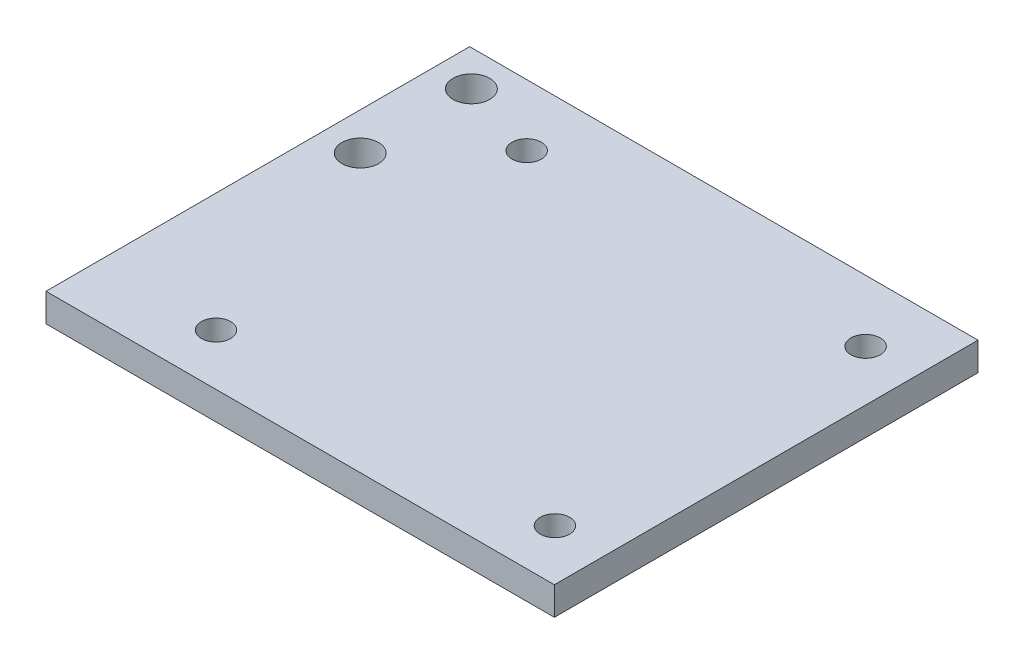
ISO-10303-21;
HEADER;
FILE_DESCRIPTION(('STEP AP214'),'2;1');
FILE_NAME('part.step','',(''),(''),'','','');
FILE_SCHEMA(('AUTOMOTIVE_DESIGN { 1 0 10303 214 1 1 1 1 }'));
ENDSEC;
DATA;
#1=APPLICATION_CONTEXT('core data for automotive mechanical design processes');
#2=APPLICATION_PROTOCOL_DEFINITION('international standard','automotive_design',2000,#1);
#3=PRODUCT_CONTEXT('',#1,'mechanical');
#4=PRODUCT('Part','Part','',(#3));
#5=PRODUCT_RELATED_PRODUCT_CATEGORY('part','',(#4));
#6=PRODUCT_DEFINITION_FORMATION('','',#4);
#7=PRODUCT_DEFINITION_CONTEXT('part definition',#1,'design');
#8=PRODUCT_DEFINITION('design','',#6,#7);
#9=PRODUCT_DEFINITION_SHAPE('','',#8);
#10=(LENGTH_UNIT() NAMED_UNIT(*) SI_UNIT(.MILLI.,.METRE.));
#11=(NAMED_UNIT(*) PLANE_ANGLE_UNIT() SI_UNIT($,.RADIAN.));
#12=(NAMED_UNIT(*) SI_UNIT($,.STERADIAN.) SOLID_ANGLE_UNIT());
#13=UNCERTAINTY_MEASURE_WITH_UNIT(LENGTH_MEASURE(1.E-05),#10,'distance_accuracy_value','');
#14=(GEOMETRIC_REPRESENTATION_CONTEXT(3) GLOBAL_UNCERTAINTY_ASSIGNED_CONTEXT((#13)) GLOBAL_UNIT_ASSIGNED_CONTEXT((#10,
#11,#12)) REPRESENTATION_CONTEXT('',''));
#15=CARTESIAN_POINT('',(0.,0.,0.));
#16=DIRECTION('',(0.,0.,1.));
#17=DIRECTION('',(1.,0.,0.));
#18=AXIS2_PLACEMENT_3D('',#15,#16,#17);
#19=CARTESIAN_POINT('',(0.,2.54,0.));
#20=DIRECTION('',(1.,0.,0.));
#21=DIRECTION('',(0.,0.,-1.));
#22=AXIS2_PLACEMENT_3D('',#19,#20,#21);
#23=PLANE('',#22);
#24=DIRECTION('',(0.,0.,1.));
#25=VECTOR('',#24,1.);
#26=CARTESIAN_POINT('',(0.,0.,0.));
#27=LINE('',#26,#25);
#28=CARTESIAN_POINT('',(0.,0.,-38.1));
#29=VERTEX_POINT('',#28);
#30=CARTESIAN_POINT('',(0.,0.,0.));
#31=VERTEX_POINT('',#30);
#32=EDGE_CURVE('E107',#29,#31,#27,.T.);
#33=ORIENTED_EDGE('',*,*,#32,.T.);
#34=DIRECTION('',(0.,-1.,0.));
#35=VECTOR('',#34,1.);
#36=CARTESIAN_POINT('',(0.,2.54,0.));
#37=LINE('',#36,#35);
#38=CARTESIAN_POINT('',(0.,2.54,0.));
#39=VERTEX_POINT('',#38);
#40=EDGE_CURVE('E11',#39,#31,#37,.T.);
#41=ORIENTED_EDGE('',*,*,#40,.F.);
#42=DIRECTION('',(0.,0.,1.));
#43=VECTOR('',#42,1.);
#44=CARTESIAN_POINT('',(0.,2.54,0.));
#45=LINE('',#44,#43);
#46=CARTESIAN_POINT('',(0.,2.54,-38.1));
#47=VERTEX_POINT('',#46);
#48=EDGE_CURVE('E91',#47,#39,#45,.T.);
#49=ORIENTED_EDGE('',*,*,#48,.F.);
#50=DIRECTION('',(0.,-1.,0.));
#51=VECTOR('',#50,1.);
#52=CARTESIAN_POINT('',(0.,2.54,-38.1));
#53=LINE('',#52,#51);
#54=EDGE_CURVE('E103',#47,#29,#53,.T.);
#55=ORIENTED_EDGE('',*,*,#54,.T.);
#56=EDGE_LOOP('',(#33,#41,#49,#55));
#57=FACE_BOUND('',#56,.T.);
#58=ADVANCED_FACE('F39',(#57),#23,.F.);
#59=CARTESIAN_POINT('',(0.,2.54,0.));
#60=DIRECTION('',(0.,0.,-1.));
#61=DIRECTION('',(-1.,0.,0.));
#62=AXIS2_PLACEMENT_3D('',#59,#60,#61);
#63=PLANE('',#62);
#64=DIRECTION('',(1.,0.,0.));
#65=VECTOR('',#64,1.);
#66=CARTESIAN_POINT('',(0.,0.,0.));
#67=LINE('',#66,#65);
#68=CARTESIAN_POINT('',(45.72,0.,0.));
#69=VERTEX_POINT('',#68);
#70=EDGE_CURVE('E96',#31,#69,#67,.T.);
#71=ORIENTED_EDGE('',*,*,#70,.T.);
#72=DIRECTION('',(0.,-1.,0.));
#73=VECTOR('',#72,1.);
#74=CARTESIAN_POINT('',(45.72,2.54,0.));
#75=LINE('',#74,#73);
#76=CARTESIAN_POINT('',(45.72,2.54,0.));
#77=VERTEX_POINT('',#76);
#78=EDGE_CURVE('E48',#77,#69,#75,.T.);
#79=ORIENTED_EDGE('',*,*,#78,.F.);
#80=DIRECTION('',(1.,0.,0.));
#81=VECTOR('',#80,1.);
#82=CARTESIAN_POINT('',(0.,2.54,0.));
#83=LINE('',#82,#81);
#84=EDGE_CURVE('E86',#39,#77,#83,.T.);
#85=ORIENTED_EDGE('',*,*,#84,.F.);
#86=ORIENTED_EDGE('',*,*,#40,.T.);
#87=EDGE_LOOP('',(#71,#79,#85,#86));
#88=FACE_BOUND('',#87,.T.);
#89=ADVANCED_FACE('F95',(#88),#63,.F.);
#90=CARTESIAN_POINT('',(45.72,2.54,0.));
#91=DIRECTION('',(-1.,0.,0.));
#92=DIRECTION('',(0.,0.,1.));
#93=AXIS2_PLACEMENT_3D('',#90,#91,#92);
#94=PLANE('',#93);
#95=DIRECTION('',(0.,0.,-1.));
#96=VECTOR('',#95,1.);
#97=CARTESIAN_POINT('',(45.72,0.,0.));
#98=LINE('',#97,#96);
#99=CARTESIAN_POINT('',(45.72,0.,-38.1));
#100=VERTEX_POINT('',#99);
#101=EDGE_CURVE('E73',#69,#100,#98,.T.);
#102=ORIENTED_EDGE('',*,*,#101,.T.);
#103=DIRECTION('',(0.,-1.,0.));
#104=VECTOR('',#103,1.);
#105=CARTESIAN_POINT('',(45.72,2.54,-38.1));
#106=LINE('',#105,#104);
#107=CARTESIAN_POINT('',(45.72,2.54,-38.1));
#108=VERTEX_POINT('',#107);
#109=EDGE_CURVE('E98',#108,#100,#106,.T.);
#110=ORIENTED_EDGE('',*,*,#109,.F.);
#111=DIRECTION('',(0.,0.,-1.));
#112=VECTOR('',#111,1.);
#113=CARTESIAN_POINT('',(45.72,2.54,0.));
#114=LINE('',#113,#112);
#115=EDGE_CURVE('E89',#77,#108,#114,.T.);
#116=ORIENTED_EDGE('',*,*,#115,.F.);
#117=ORIENTED_EDGE('',*,*,#78,.T.);
#118=EDGE_LOOP('',(#102,#110,#116,#117));
#119=FACE_BOUND('',#118,.T.);
#120=ADVANCED_FACE('F99',(#119),#94,.F.);
#121=CARTESIAN_POINT('',(0.,2.54,-38.1));
#122=DIRECTION('',(0.,0.,1.));
#123=DIRECTION('',(1.,0.,0.));
#124=AXIS2_PLACEMENT_3D('',#121,#122,#123);
#125=PLANE('',#124);
#126=DIRECTION('',(-1.,0.,0.));
#127=VECTOR('',#126,1.);
#128=CARTESIAN_POINT('',(0.,0.,-38.1));
#129=LINE('',#128,#127);
#130=EDGE_CURVE('E79',#100,#29,#129,.T.);
#131=ORIENTED_EDGE('',*,*,#130,.T.);
#132=ORIENTED_EDGE('',*,*,#54,.F.);
#133=DIRECTION('',(-1.,0.,0.));
#134=VECTOR('',#133,1.);
#135=CARTESIAN_POINT('',(0.,2.54,-38.1));
#136=LINE('',#135,#134);
#137=EDGE_CURVE('E56',#108,#47,#136,.T.);
#138=ORIENTED_EDGE('',*,*,#137,.F.);
#139=ORIENTED_EDGE('',*,*,#109,.T.);
#140=EDGE_LOOP('',(#131,#132,#138,#139));
#141=FACE_BOUND('',#140,.T.);
#142=ADVANCED_FACE('F121',(#141),#125,.F.);
#143=CARTESIAN_POINT('',(0.,2.54,0.));
#144=DIRECTION('',(0.,-1.,0.));
#145=DIRECTION('',(0.,0.,-1.));
#146=AXIS2_PLACEMENT_3D('',#143,#144,#145);
#147=PLANE('',#146);
#148=CARTESIAN_POINT('',(41.148,2.54,-4.62280000000001));
#149=DIRECTION('',(0.,-1.,0.));
#150=DIRECTION('',(0.,0.,-1.));
#151=AXIS2_PLACEMENT_3D('',#148,#149,#150);
#152=CIRCLE('',#151,1.32);
#153=CARTESIAN_POINT('',(41.148,2.54,-5.94280000000001));
#154=VERTEX_POINT('',#153);
#155=EDGE_CURVE('E152',#154,#154,#152,.F.);
#156=ORIENTED_EDGE('',*,*,#155,.F.);
#157=EDGE_LOOP('',(#156));
#158=FACE_BOUND('',#157,.T.);
#159=CARTESIAN_POINT('',(10.668,2.54,-32.5628));
#160=DIRECTION('',(0.,-1.,0.));
#161=DIRECTION('',(0.,0.,-1.));
#162=AXIS2_PLACEMENT_3D('',#159,#160,#161);
#163=CIRCLE('',#162,1.32);
#164=CARTESIAN_POINT('',(10.668,2.54,-33.8828));
#165=VERTEX_POINT('',#164);
#166=EDGE_CURVE('E145',#165,#165,#163,.F.);
#167=ORIENTED_EDGE('',*,*,#166,.F.);
#168=EDGE_LOOP('',(#167));
#169=FACE_BOUND('',#168,.T.);
#170=CARTESIAN_POINT('',(10.668,2.54,-4.62280000000001));
#171=DIRECTION('',(0.,-1.,0.));
#172=DIRECTION('',(0.,0.,-1.));
#173=AXIS2_PLACEMENT_3D('',#170,#171,#172);
#174=CIRCLE('',#173,1.32);
#175=CARTESIAN_POINT('',(10.668,2.54,-5.94280000000001));
#176=VERTEX_POINT('',#175);
#177=EDGE_CURVE('E136',#176,#176,#174,.F.);
#178=ORIENTED_EDGE('',*,*,#177,.F.);
#179=EDGE_LOOP('',(#178));
#180=FACE_BOUND('',#179,.T.);
#181=CARTESIAN_POINT('',(3.3655,2.54,-34.892));
#182=DIRECTION('',(0.,-1.,0.));
#183=DIRECTION('',(0.,0.,-1.));
#184=AXIS2_PLACEMENT_3D('',#181,#182,#183);
#185=CIRCLE('',#184,1.65);
#186=CARTESIAN_POINT('',(3.3655,2.54,-36.542));
#187=VERTEX_POINT('',#186);
#188=EDGE_CURVE('E135',#187,#187,#185,.F.);
#189=ORIENTED_EDGE('',*,*,#188,.F.);
#190=EDGE_LOOP('',(#189));
#191=FACE_BOUND('',#190,.T.);
#192=CARTESIAN_POINT('',(41.148,2.54,-32.5628));
#193=DIRECTION('',(0.,-1.,0.));
#194=DIRECTION('',(0.,0.,-1.));
#195=AXIS2_PLACEMENT_3D('',#192,#193,#194);
#196=CIRCLE('',#195,1.32);
#197=CARTESIAN_POINT('',(41.148,2.54,-33.8828));
#198=VERTEX_POINT('',#197);
#199=EDGE_CURVE('E161',#198,#198,#196,.F.);
#200=ORIENTED_EDGE('',*,*,#199,.F.);
#201=EDGE_LOOP('',(#200));
#202=FACE_BOUND('',#201,.T.);
#203=CARTESIAN_POINT('',(3.3655,2.54,-24.892));
#204=DIRECTION('',(0.,-1.,0.));
#205=DIRECTION('',(0.,0.,-1.));
#206=AXIS2_PLACEMENT_3D('',#203,#204,#205);
#207=CIRCLE('',#206,1.65);
#208=CARTESIAN_POINT('',(3.3655,2.54,-26.542));
#209=VERTEX_POINT('',#208);
#210=EDGE_CURVE('E111',#209,#209,#207,.F.);
#211=ORIENTED_EDGE('',*,*,#210,.F.);
#212=EDGE_LOOP('',(#211));
#213=FACE_BOUND('',#212,.T.);
#214=ORIENTED_EDGE('',*,*,#48,.T.);
#215=ORIENTED_EDGE('',*,*,#84,.T.);
#216=ORIENTED_EDGE('',*,*,#115,.T.);
#217=ORIENTED_EDGE('',*,*,#137,.T.);
#218=EDGE_LOOP('',(#214,#215,#216,#217));
#219=FACE_BOUND('',#218,.T.);
#220=ADVANCED_FACE('F87',(#158,#169,#180,#191,#202,#213,#219),#147,.F.);
#221=CARTESIAN_POINT('',(0.,0.,0.));
#222=DIRECTION('',(0.,-1.,0.));
#223=DIRECTION('',(0.,0.,-1.));
#224=AXIS2_PLACEMENT_3D('',#221,#222,#223);
#225=PLANE('',#224);
#226=CARTESIAN_POINT('',(41.148,0.,-4.62280000000001));
#227=DIRECTION('',(0.,-1.,0.));
#228=DIRECTION('',(0.,0.,-1.));
#229=AXIS2_PLACEMENT_3D('',#226,#227,#228);
#230=CIRCLE('',#229,1.32);
#231=CARTESIAN_POINT('',(41.148,0.,-5.94280000000001));
#232=VERTEX_POINT('',#231);
#233=EDGE_CURVE('E157',#232,#232,#230,.T.);
#234=ORIENTED_EDGE('',*,*,#233,.F.);
#235=EDGE_LOOP('',(#234));
#236=FACE_BOUND('',#235,.T.);
#237=CARTESIAN_POINT('',(10.668,0.,-32.5628));
#238=DIRECTION('',(0.,-1.,0.));
#239=DIRECTION('',(0.,0.,-1.));
#240=AXIS2_PLACEMENT_3D('',#237,#238,#239);
#241=CIRCLE('',#240,1.32);
#242=CARTESIAN_POINT('',(10.668,0.,-33.8828));
#243=VERTEX_POINT('',#242);
#244=EDGE_CURVE('E156',#243,#243,#241,.T.);
#245=ORIENTED_EDGE('',*,*,#244,.F.);
#246=EDGE_LOOP('',(#245));
#247=FACE_BOUND('',#246,.T.);
#248=CARTESIAN_POINT('',(10.668,0.,-4.62280000000001));
#249=DIRECTION('',(0.,-1.,0.));
#250=DIRECTION('',(0.,0.,-1.));
#251=AXIS2_PLACEMENT_3D('',#248,#249,#250);
#252=CIRCLE('',#251,1.32);
#253=CARTESIAN_POINT('',(10.668,0.,-5.94280000000001));
#254=VERTEX_POINT('',#253);
#255=EDGE_CURVE('E141',#254,#254,#252,.T.);
#256=ORIENTED_EDGE('',*,*,#255,.F.);
#257=EDGE_LOOP('',(#256));
#258=FACE_BOUND('',#257,.T.);
#259=CARTESIAN_POINT('',(3.3655,0.,-34.892));
#260=DIRECTION('',(0.,-1.,0.));
#261=DIRECTION('',(0.,0.,-1.));
#262=AXIS2_PLACEMENT_3D('',#259,#260,#261);
#263=CIRCLE('',#262,1.65);
#264=CARTESIAN_POINT('',(3.3655,0.,-36.542));
#265=VERTEX_POINT('',#264);
#266=EDGE_CURVE('E140',#265,#265,#263,.T.);
#267=ORIENTED_EDGE('',*,*,#266,.F.);
#268=EDGE_LOOP('',(#267));
#269=FACE_BOUND('',#268,.T.);
#270=CARTESIAN_POINT('',(41.148,0.,-32.5628));
#271=DIRECTION('',(0.,-1.,0.));
#272=DIRECTION('',(0.,0.,-1.));
#273=AXIS2_PLACEMENT_3D('',#270,#271,#272);
#274=CIRCLE('',#273,1.32);
#275=CARTESIAN_POINT('',(41.148,0.,-33.8828));
#276=VERTEX_POINT('',#275);
#277=EDGE_CURVE('E171',#276,#276,#274,.T.);
#278=ORIENTED_EDGE('',*,*,#277,.F.);
#279=EDGE_LOOP('',(#278));
#280=FACE_BOUND('',#279,.T.);
#281=CARTESIAN_POINT('',(3.3655,0.,-24.892));
#282=DIRECTION('',(0.,-1.,0.));
#283=DIRECTION('',(0.,0.,-1.));
#284=AXIS2_PLACEMENT_3D('',#281,#282,#283);
#285=CIRCLE('',#284,1.65);
#286=CARTESIAN_POINT('',(3.3655,0.,-26.542));
#287=VERTEX_POINT('',#286);
#288=EDGE_CURVE('E131',#287,#287,#285,.T.);
#289=ORIENTED_EDGE('',*,*,#288,.F.);
#290=EDGE_LOOP('',(#289));
#291=FACE_BOUND('',#290,.T.);
#292=ORIENTED_EDGE('',*,*,#32,.F.);
#293=ORIENTED_EDGE('',*,*,#130,.F.);
#294=ORIENTED_EDGE('',*,*,#101,.F.);
#295=ORIENTED_EDGE('',*,*,#70,.F.);
#296=EDGE_LOOP('',(#292,#293,#294,#295));
#297=FACE_BOUND('',#296,.T.);
#298=ADVANCED_FACE('F124',(#236,#247,#258,#269,#280,#291,#297),#225,.T.);
#299=CARTESIAN_POINT('',(3.3655,7.20690475583121,-24.892));
#300=DIRECTION('',(0.,-1.,0.));
#301=DIRECTION('',(0.,0.,-1.));
#302=AXIS2_PLACEMENT_3D('',#299,#300,#301);
#303=CYLINDRICAL_SURFACE('',#302,1.65);
#304=ORIENTED_EDGE('',*,*,#210,.T.);
#305=EDGE_LOOP('',(#304));
#306=FACE_BOUND('',#305,.T.);
#307=ORIENTED_EDGE('',*,*,#288,.T.);
#308=EDGE_LOOP('',(#307));
#309=FACE_BOUND('',#308,.T.);
#310=ADVANCED_FACE('F180',(#306,#309),#303,.F.);
#311=CARTESIAN_POINT('',(41.148,7.20690475583121,-32.5628));
#312=DIRECTION('',(0.,-1.,0.));
#313=DIRECTION('',(0.,0.,-1.));
#314=AXIS2_PLACEMENT_3D('',#311,#312,#313);
#315=CYLINDRICAL_SURFACE('',#314,1.32);
#316=ORIENTED_EDGE('',*,*,#199,.T.);
#317=EDGE_LOOP('',(#316));
#318=FACE_BOUND('',#317,.T.);
#319=ORIENTED_EDGE('',*,*,#277,.T.);
#320=EDGE_LOOP('',(#319));
#321=FACE_BOUND('',#320,.T.);
#322=ADVANCED_FACE('F176',(#318,#321),#315,.F.);
#323=CARTESIAN_POINT('',(3.3655,7.20690475583121,-34.892));
#324=DIRECTION('',(0.,-1.,0.));
#325=DIRECTION('',(0.,0.,-1.));
#326=AXIS2_PLACEMENT_3D('',#323,#324,#325);
#327=CYLINDRICAL_SURFACE('',#326,1.65);
#328=ORIENTED_EDGE('',*,*,#188,.T.);
#329=EDGE_LOOP('',(#328));
#330=FACE_BOUND('',#329,.T.);
#331=ORIENTED_EDGE('',*,*,#266,.T.);
#332=EDGE_LOOP('',(#331));
#333=FACE_BOUND('',#332,.T.);
#334=ADVANCED_FACE('F191',(#330,#333),#327,.F.);
#335=CARTESIAN_POINT('',(10.668,7.20690475583121,-4.62280000000001));
#336=DIRECTION('',(0.,-1.,0.));
#337=DIRECTION('',(0.,0.,-1.));
#338=AXIS2_PLACEMENT_3D('',#335,#336,#337);
#339=CYLINDRICAL_SURFACE('',#338,1.32);
#340=ORIENTED_EDGE('',*,*,#177,.T.);
#341=EDGE_LOOP('',(#340));
#342=FACE_BOUND('',#341,.T.);
#343=ORIENTED_EDGE('',*,*,#255,.T.);
#344=EDGE_LOOP('',(#343));
#345=FACE_BOUND('',#344,.T.);
#346=ADVANCED_FACE('F224',(#342,#345),#339,.F.);
#347=CARTESIAN_POINT('',(10.668,7.20690475583121,-32.5628));
#348=DIRECTION('',(0.,-1.,0.));
#349=DIRECTION('',(0.,0.,-1.));
#350=AXIS2_PLACEMENT_3D('',#347,#348,#349);
#351=CYLINDRICAL_SURFACE('',#350,1.32);
#352=ORIENTED_EDGE('',*,*,#166,.T.);
#353=EDGE_LOOP('',(#352));
#354=FACE_BOUND('',#353,.T.);
#355=ORIENTED_EDGE('',*,*,#244,.T.);
#356=EDGE_LOOP('',(#355));
#357=FACE_BOUND('',#356,.T.);
#358=ADVANCED_FACE('F231',(#354,#357),#351,.F.);
#359=CARTESIAN_POINT('',(41.148,7.20690475583121,-4.62280000000001));
#360=DIRECTION('',(0.,-1.,0.));
#361=DIRECTION('',(0.,0.,-1.));
#362=AXIS2_PLACEMENT_3D('',#359,#360,#361);
#363=CYLINDRICAL_SURFACE('',#362,1.32);
#364=ORIENTED_EDGE('',*,*,#155,.T.);
#365=EDGE_LOOP('',(#364));
#366=FACE_BOUND('',#365,.T.);
#367=ORIENTED_EDGE('',*,*,#233,.T.);
#368=EDGE_LOOP('',(#367));
#369=FACE_BOUND('',#368,.T.);
#370=ADVANCED_FACE('F234',(#366,#369),#363,.F.);
#371=CLOSED_SHELL('',(#58,#89,#120,#142,#220,#298,#310,#322,#334,#346,#358,#370));
#372=MANIFOLD_SOLID_BREP('B2',#371);
#373=ADVANCED_BREP_SHAPE_REPRESENTATION('',(#18,#372),#14);
#374=SHAPE_DEFINITION_REPRESENTATION(#9,#373);
ENDSEC;
END-ISO-10303-21;
